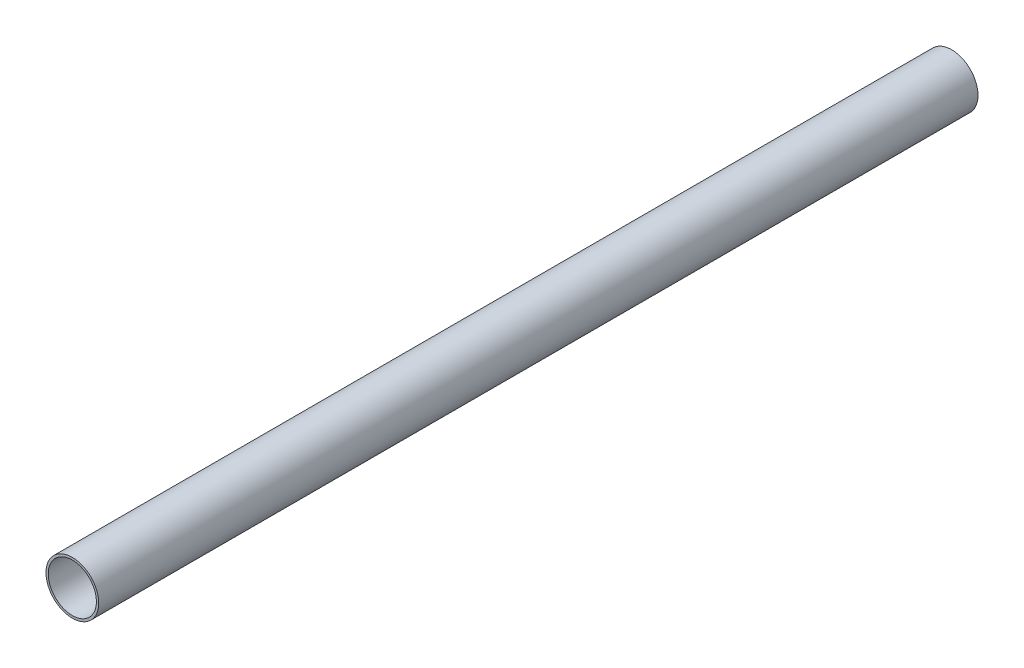
ISO-10303-21;
HEADER;
FILE_DESCRIPTION(('STEP AP214'),'2;1');
FILE_NAME('part.step','',(''),(''),'','','');
FILE_SCHEMA(('AUTOMOTIVE_DESIGN { 1 0 10303 214 1 1 1 1 }'));
ENDSEC;
DATA;
#1=APPLICATION_CONTEXT('core data for automotive mechanical design processes');
#2=APPLICATION_PROTOCOL_DEFINITION('international standard','automotive_design',2000,#1);
#3=PRODUCT_CONTEXT('',#1,'mechanical');
#4=PRODUCT('Part','Part','',(#3));
#5=PRODUCT_RELATED_PRODUCT_CATEGORY('part','',(#4));
#6=PRODUCT_DEFINITION_FORMATION('','',#4);
#7=PRODUCT_DEFINITION_CONTEXT('part definition',#1,'design');
#8=PRODUCT_DEFINITION('design','',#6,#7);
#9=PRODUCT_DEFINITION_SHAPE('','',#8);
#10=(LENGTH_UNIT() NAMED_UNIT(*) SI_UNIT(.MILLI.,.METRE.));
#11=(NAMED_UNIT(*) PLANE_ANGLE_UNIT() SI_UNIT($,.RADIAN.));
#12=(NAMED_UNIT(*) SI_UNIT($,.STERADIAN.) SOLID_ANGLE_UNIT());
#13=UNCERTAINTY_MEASURE_WITH_UNIT(LENGTH_MEASURE(1.E-05),#10,'distance_accuracy_value','');
#14=(GEOMETRIC_REPRESENTATION_CONTEXT(3) GLOBAL_UNCERTAINTY_ASSIGNED_CONTEXT((#13)) GLOBAL_UNIT_ASSIGNED_CONTEXT((#10,
#11,#12)) REPRESENTATION_CONTEXT('',''));
#15=CARTESIAN_POINT('',(0.,0.,0.));
#16=DIRECTION('',(0.,0.,1.));
#17=DIRECTION('',(1.,0.,0.));
#18=AXIS2_PLACEMENT_3D('',#15,#16,#17);
#19=CARTESIAN_POINT('',(0.,0.,400.));
#20=DIRECTION('',(0.,0.,1.));
#21=DIRECTION('',(1.,0.,0.));
#22=AXIS2_PLACEMENT_3D('',#19,#20,#21);
#23=PLANE('',#22);
#24=CARTESIAN_POINT('',(0.,0.,400.));
#25=DIRECTION('',(0.,0.,1.));
#26=DIRECTION('',(1.,0.,0.));
#27=AXIS2_PLACEMENT_3D('',#24,#25,#26);
#28=CIRCLE('',#27,12.);
#29=CARTESIAN_POINT('',(12.,0.,400.));
#30=VERTEX_POINT('',#29);
#31=EDGE_CURVE('E10',#30,#30,#28,.T.);
#32=ORIENTED_EDGE('',*,*,#31,.T.);
#33=EDGE_LOOP('',(#32));
#34=FACE_BOUND('',#33,.T.);
#35=CARTESIAN_POINT('',(0.,0.,400.));
#36=DIRECTION('',(0.,0.,1.));
#37=DIRECTION('',(1.,0.,0.));
#38=AXIS2_PLACEMENT_3D('',#35,#36,#37);
#39=CIRCLE('',#38,10.95);
#40=CARTESIAN_POINT('',(10.95,0.,400.));
#41=VERTEX_POINT('',#40);
#42=EDGE_CURVE('E48',#41,#41,#39,.T.);
#43=ORIENTED_EDGE('',*,*,#42,.F.);
#44=EDGE_LOOP('',(#43));
#45=FACE_BOUND('',#44,.T.);
#46=ADVANCED_FACE('F37',(#34,#45),#23,.T.);
#47=CARTESIAN_POINT('',(0.,0.,0.));
#48=DIRECTION('',(0.,0.,1.));
#49=DIRECTION('',(1.,0.,0.));
#50=AXIS2_PLACEMENT_3D('',#47,#48,#49);
#51=PLANE('',#50);
#52=CARTESIAN_POINT('',(0.,0.,0.));
#53=DIRECTION('',(0.,0.,1.));
#54=DIRECTION('',(1.,0.,0.));
#55=AXIS2_PLACEMENT_3D('',#52,#53,#54);
#56=CIRCLE('',#55,12.);
#57=CARTESIAN_POINT('',(12.,0.,0.));
#58=VERTEX_POINT('',#57);
#59=EDGE_CURVE('E41',#58,#58,#56,.T.);
#60=ORIENTED_EDGE('',*,*,#59,.F.);
#61=EDGE_LOOP('',(#60));
#62=FACE_BOUND('',#61,.T.);
#63=CARTESIAN_POINT('',(0.,0.,0.));
#64=DIRECTION('',(0.,0.,1.));
#65=DIRECTION('',(1.,0.,0.));
#66=AXIS2_PLACEMENT_3D('',#63,#64,#65);
#67=CIRCLE('',#66,10.95);
#68=CARTESIAN_POINT('',(10.95,0.,0.));
#69=VERTEX_POINT('',#68);
#70=EDGE_CURVE('E50',#69,#69,#67,.T.);
#71=ORIENTED_EDGE('',*,*,#70,.T.);
#72=EDGE_LOOP('',(#71));
#73=FACE_BOUND('',#72,.T.);
#74=ADVANCED_FACE('F60',(#62,#73),#51,.F.);
#75=CARTESIAN_POINT('',(0.,0.,400.));
#76=DIRECTION('',(0.,0.,-1.));
#77=DIRECTION('',(-1.,0.,0.));
#78=AXIS2_PLACEMENT_3D('',#75,#76,#77);
#79=CYLINDRICAL_SURFACE('',#78,12.);
#80=ORIENTED_EDGE('',*,*,#31,.F.);
#81=EDGE_LOOP('',(#80));
#82=FACE_BOUND('',#81,.T.);
#83=ORIENTED_EDGE('',*,*,#59,.T.);
#84=EDGE_LOOP('',(#83));
#85=FACE_BOUND('',#84,.T.);
#86=ADVANCED_FACE('F39',(#82,#85),#79,.T.);
#87=CARTESIAN_POINT('',(0.,0.,400.));
#88=DIRECTION('',(0.,0.,-1.));
#89=DIRECTION('',(-1.,0.,0.));
#90=AXIS2_PLACEMENT_3D('',#87,#88,#89);
#91=CYLINDRICAL_SURFACE('',#90,10.95);
#92=ORIENTED_EDGE('',*,*,#42,.T.);
#93=EDGE_LOOP('',(#92));
#94=FACE_BOUND('',#93,.T.);
#95=ORIENTED_EDGE('',*,*,#70,.F.);
#96=EDGE_LOOP('',(#95));
#97=FACE_BOUND('',#96,.T.);
#98=ADVANCED_FACE('F56',(#94,#97),#91,.F.);
#99=CLOSED_SHELL('',(#46,#74,#86,#98));
#100=MANIFOLD_SOLID_BREP('B2',#99);
#101=ADVANCED_BREP_SHAPE_REPRESENTATION('',(#18,#100),#14);
#102=SHAPE_DEFINITION_REPRESENTATION(#9,#101);
ENDSEC;
END-ISO-10303-21;
